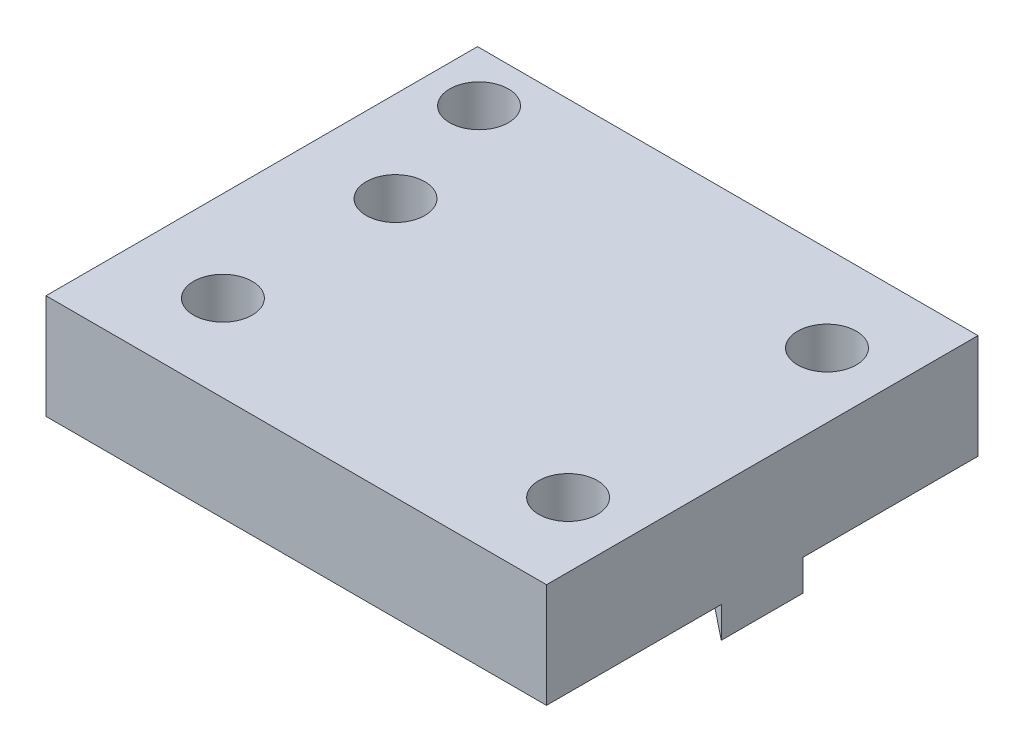
ISO-10303-21;
HEADER;
FILE_DESCRIPTION(('STEP AP214'),'2;1');
FILE_NAME('part.step','',(''),(''),'','','');
FILE_SCHEMA(('AUTOMOTIVE_DESIGN { 1 0 10303 214 1 1 1 1 }'));
ENDSEC;
DATA;
#1=APPLICATION_CONTEXT('core data for automotive mechanical design processes');
#2=APPLICATION_PROTOCOL_DEFINITION('international standard','automotive_design',2000,#1);
#3=PRODUCT_CONTEXT('',#1,'mechanical');
#4=PRODUCT('Part','Part','',(#3));
#5=PRODUCT_RELATED_PRODUCT_CATEGORY('part','',(#4));
#6=PRODUCT_DEFINITION_FORMATION('','',#4);
#7=PRODUCT_DEFINITION_CONTEXT('part definition',#1,'design');
#8=PRODUCT_DEFINITION('design','',#6,#7);
#9=PRODUCT_DEFINITION_SHAPE('','',#8);
#10=(LENGTH_UNIT() NAMED_UNIT(*) SI_UNIT(.MILLI.,.METRE.));
#11=(NAMED_UNIT(*) PLANE_ANGLE_UNIT() SI_UNIT($,.RADIAN.));
#12=(NAMED_UNIT(*) SI_UNIT($,.STERADIAN.) SOLID_ANGLE_UNIT());
#13=UNCERTAINTY_MEASURE_WITH_UNIT(LENGTH_MEASURE(1.E-05),#10,'distance_accuracy_value','');
#14=(GEOMETRIC_REPRESENTATION_CONTEXT(3) GLOBAL_UNCERTAINTY_ASSIGNED_CONTEXT((#13)) GLOBAL_UNIT_ASSIGNED_CONTEXT((#10,
#11,#12)) REPRESENTATION_CONTEXT('',''));
#15=CARTESIAN_POINT('',(0.,0.,0.));
#16=DIRECTION('',(0.,0.,1.));
#17=DIRECTION('',(1.,0.,0.));
#18=AXIS2_PLACEMENT_3D('',#15,#16,#17);
#19=CARTESIAN_POINT('',(0.,15.4164043197796,57.0004422851704));
#20=DIRECTION('',(0.,0.,-1.));
#21=DIRECTION('',(-1.,0.,0.));
#22=AXIS2_PLACEMENT_3D('',#19,#20,#21);
#23=CYLINDRICAL_SURFACE('',#22,12.);
#24=DIRECTION('',(0.,0.,-1.));
#25=VECTOR('',#24,1.);
#26=CARTESIAN_POINT('',(8.83271594697806,23.5394043197795,57.0004422851701));
#27=LINE('',#26,#25);
#28=CARTESIAN_POINT('',(8.83271594697806,23.5394043197795,57.5004422851702));
#29=VERTEX_POINT('',#28);
#30=CARTESIAN_POINT('',(8.83271594697801,23.5394043197795,53.5004422851702));
#31=VERTEX_POINT('',#30);
#32=EDGE_CURVE('E265',#29,#31,#27,.T.);
#33=ORIENTED_EDGE('',*,*,#32,.F.);
#34=CARTESIAN_POINT('',(0.,15.4164043197796,57.5004422851702));
#35=DIRECTION('',(0.,0.,1.));
#36=DIRECTION('',(-1.,0.,0.));
#37=AXIS2_PLACEMENT_3D('',#34,#35,#36);
#38=CIRCLE('',#37,12.);
#39=CARTESIAN_POINT('',(-8.83271594697804,23.5394043197795,57.5004422851704));
#40=VERTEX_POINT('',#39);
#41=EDGE_CURVE('E9',#29,#40,#38,.T.);
#42=ORIENTED_EDGE('',*,*,#41,.T.);
#43=DIRECTION('',(0.,0.,1.));
#44=VECTOR('',#43,1.);
#45=CARTESIAN_POINT('',(-8.83271594697804,23.5394043197795,57.0004422851704));
#46=LINE('',#45,#44);
#47=CARTESIAN_POINT('',(-8.83271594697809,23.5394043197795,53.5004422851704));
#48=VERTEX_POINT('',#47);
#49=EDGE_CURVE('E333',#48,#40,#46,.T.);
#50=ORIENTED_EDGE('',*,*,#49,.F.);
#51=CARTESIAN_POINT('',(0.,15.4164043197796,53.5004422851702));
#52=DIRECTION('',(0.,0.,-1.));
#53=DIRECTION('',(-1.,0.,0.));
#54=AXIS2_PLACEMENT_3D('',#51,#52,#53);
#55=CIRCLE('',#54,12.);
#56=EDGE_CURVE('E24',#48,#31,#55,.T.);
#57=ORIENTED_EDGE('',*,*,#56,.T.);
#58=EDGE_LOOP('',(#33,#42,#50,#57));
#59=FACE_BOUND('',#58,.T.);
#60=ADVANCED_FACE('F14',(#59),#23,.F.);
#61=CARTESIAN_POINT('',(0.499999999999862,15.4164043197796,57.5004422851702));
#62=DIRECTION('',(0.,0.,-1.));
#63=DIRECTION('',(-1.,0.,0.));
#64=AXIS2_PLACEMENT_3D('',#61,#62,#63);
#65=PLANE('',#64);
#66=DIRECTION('',(1.,0.,0.));
#67=VECTOR('',#66,1.);
#68=CARTESIAN_POINT('',(-0.067499858140971,23.5394043197795,57.5004422851702));
#69=LINE('',#68,#67);
#70=EDGE_CURVE('E311',#40,#29,#69,.T.);
#71=ORIENTED_EDGE('',*,*,#70,.F.);
#72=ORIENTED_EDGE('',*,*,#41,.F.);
#73=EDGE_LOOP('',(#71,#72));
#74=FACE_BOUND('',#73,.T.);
#75=ADVANCED_FACE('F591',(#74),#65,.T.);
#76=CARTESIAN_POINT('',(0.499999999999811,15.4164043197796,53.5004422851702));
#77=DIRECTION('',(0.,0.,-1.));
#78=DIRECTION('',(-1.,0.,0.));
#79=AXIS2_PLACEMENT_3D('',#76,#77,#78);
#80=PLANE('',#79);
#81=CARTESIAN_POINT('',(0.,15.4164043197796,53.5004422851702));
#82=DIRECTION('',(0.,0.,-1.));
#83=DIRECTION('',(-1.,0.,0.));
#84=AXIS2_PLACEMENT_3D('',#81,#82,#83);
#85=CIRCLE('',#84,10.668);
#86=CARTESIAN_POINT('',(-6.91542442659887,23.5394043197795,53.5004422851704));
#87=VERTEX_POINT('',#86);
#88=CARTESIAN_POINT('',(6.9154244265989,23.5394043197795,53.5004422851702));
#89=VERTEX_POINT('',#88);
#90=EDGE_CURVE('E350',#87,#89,#85,.T.);
#91=ORIENTED_EDGE('',*,*,#90,.T.);
#92=DIRECTION('',(-1.,0.,0.));
#93=VECTOR('',#92,1.);
#94=CARTESIAN_POINT('',(-0.0674998581410224,23.5394043197795,53.5004422851702));
#95=LINE('',#94,#93);
#96=EDGE_CURVE('E260',#31,#89,#95,.T.);
#97=ORIENTED_EDGE('',*,*,#96,.F.);
#98=ORIENTED_EDGE('',*,*,#56,.F.);
#99=DIRECTION('',(-1.,0.,0.));
#100=VECTOR('',#99,1.);
#101=CARTESIAN_POINT('',(-0.0674998581410224,23.5394043197795,53.5004422851702));
#102=LINE('',#101,#100);
#103=EDGE_CURVE('E332',#87,#48,#102,.T.);
#104=ORIENTED_EDGE('',*,*,#103,.F.);
#105=EDGE_LOOP('',(#91,#97,#98,#104));
#106=FACE_BOUND('',#105,.T.);
#107=ADVANCED_FACE('F679',(#106),#80,.F.);
#108=CARTESIAN_POINT('',(0.,15.4164043197796,35.5120422851699));
#109=DIRECTION('',(0.,0.,1.));
#110=DIRECTION('',(-1.,0.,0.));
#111=AXIS2_PLACEMENT_3D('',#108,#109,#110);
#112=CYLINDRICAL_SURFACE('',#111,10.668);
#113=ORIENTED_EDGE('',*,*,#90,.F.);
#114=DIRECTION('',(0.,0.,1.));
#115=VECTOR('',#114,1.);
#116=CARTESIAN_POINT('',(-6.91542442659887,23.5394043197795,35.5120422851699));
#117=LINE('',#116,#115);
#118=CARTESIAN_POINT('',(-6.91542442659887,23.5394043197795,35.5120422851699));
#119=VERTEX_POINT('',#118);
#120=EDGE_CURVE('E328',#119,#87,#117,.T.);
#121=ORIENTED_EDGE('',*,*,#120,.F.);
#122=CARTESIAN_POINT('',(0.,15.4164043197796,35.5120422851699));
#123=DIRECTION('',(0.,0.,1.));
#124=DIRECTION('',(-1.,0.,0.));
#125=AXIS2_PLACEMENT_3D('',#122,#123,#124);
#126=CIRCLE('',#125,10.668);
#127=CARTESIAN_POINT('',(6.9154244265989,23.5394043197795,35.5120422851699));
#128=VERTEX_POINT('',#127);
#129=EDGE_CURVE('E341',#128,#119,#126,.T.);
#130=ORIENTED_EDGE('',*,*,#129,.F.);
#131=DIRECTION('',(0.,0.,-1.));
#132=VECTOR('',#131,1.);
#133=CARTESIAN_POINT('',(6.9154244265989,23.5394043197795,35.5120422851699));
#134=LINE('',#133,#132);
#135=EDGE_CURVE('E264',#89,#128,#134,.T.);
#136=ORIENTED_EDGE('',*,*,#135,.F.);
#137=EDGE_LOOP('',(#113,#121,#130,#136));
#138=FACE_BOUND('',#137,.T.);
#139=ADVANCED_FACE('F683',(#138),#112,.F.);
#140=CARTESIAN_POINT('',(13.0175,28.3654043197795,60.9120422851699));
#141=DIRECTION('',(0.,-1.,0.));
#142=DIRECTION('',(0.,0.,1.));
#143=AXIS2_PLACEMENT_3D('',#140,#141,#142);
#144=CYLINDRICAL_SURFACE('',#143,2.159);
#145=CARTESIAN_POINT('',(13.0175,31.2307783197794,60.9120422851699));
#146=DIRECTION('',(0.,1.,0.));
#147=DIRECTION('',(0.,0.,1.));
#148=AXIS2_PLACEMENT_3D('',#145,#146,#147);
#149=CIRCLE('',#148,2.159);
#150=CARTESIAN_POINT('',(13.0175,31.2307783197794,58.7530422851699));
#151=VERTEX_POINT('',#150);
#152=EDGE_CURVE('E289',#151,#151,#149,.T.);
#153=ORIENTED_EDGE('',*,*,#152,.T.);
#154=DIRECTION('',(0.,-1.,0.));
#155=VECTOR('',#154,1.);
#156=CARTESIAN_POINT('',(13.0175,28.3654043197795,58.7530422851699));
#157=LINE('',#156,#155);
#158=CARTESIAN_POINT('',(13.0175,23.5394043197795,58.7530422851699));
#159=VERTEX_POINT('',#158);
#160=EDGE_CURVE('E351',#151,#159,#157,.T.);
#161=ORIENTED_EDGE('',*,*,#160,.T.);
#162=CARTESIAN_POINT('',(13.0175,23.5394043197795,60.9120422851699));
#163=DIRECTION('',(0.,1.,0.));
#164=DIRECTION('',(0.,0.,1.));
#165=AXIS2_PLACEMENT_3D('',#162,#163,#164);
#166=CIRCLE('',#165,2.159);
#167=EDGE_CURVE('E301',#159,#159,#166,.T.);
#168=ORIENTED_EDGE('',*,*,#167,.F.);
#169=ORIENTED_EDGE('',*,*,#160,.F.);
#170=EDGE_LOOP('',(#153,#161,#168,#169));
#171=FACE_BOUND('',#170,.T.);
#172=ADVANCED_FACE('F697',(#171),#144,.F.);
#173=CARTESIAN_POINT('',(-15.2199031805057,28.3654043197795,39.22604228517));
#174=DIRECTION('',(0.,-1.,0.));
#175=DIRECTION('',(0.,0.,1.));
#176=AXIS2_PLACEMENT_3D('',#173,#174,#175);
#177=CYLINDRICAL_SURFACE('',#176,2.159);
#178=CARTESIAN_POINT('',(-15.2199031805057,31.2307783197794,39.22604228517));
#179=DIRECTION('',(0.,1.,0.));
#180=DIRECTION('',(0.,0.,1.));
#181=AXIS2_PLACEMENT_3D('',#178,#179,#180);
#182=CIRCLE('',#181,2.159);
#183=CARTESIAN_POINT('',(-15.2199031805057,31.2307783197794,37.06704228517));
#184=VERTEX_POINT('',#183);
#185=EDGE_CURVE('E285',#184,#184,#182,.T.);
#186=ORIENTED_EDGE('',*,*,#185,.T.);
#187=DIRECTION('',(0.,-1.,0.));
#188=VECTOR('',#187,1.);
#189=CARTESIAN_POINT('',(-15.2199031805057,28.3654043197795,37.06704228517));
#190=LINE('',#189,#188);
#191=CARTESIAN_POINT('',(-15.2199031805057,23.5394043197795,37.06704228517));
#192=VERTEX_POINT('',#191);
#193=EDGE_CURVE('E269',#184,#192,#190,.T.);
#194=ORIENTED_EDGE('',*,*,#193,.T.);
#195=CARTESIAN_POINT('',(-15.2199031805057,23.5394043197795,39.22604228517));
#196=DIRECTION('',(0.,1.,0.));
#197=DIRECTION('',(0.,0.,1.));
#198=AXIS2_PLACEMENT_3D('',#195,#196,#197);
#199=CIRCLE('',#198,2.159);
#200=EDGE_CURVE('E284',#192,#192,#199,.T.);
#201=ORIENTED_EDGE('',*,*,#200,.F.);
#202=ORIENTED_EDGE('',*,*,#193,.F.);
#203=EDGE_LOOP('',(#186,#194,#201,#202));
#204=FACE_BOUND('',#203,.T.);
#205=ADVANCED_FACE('F619',(#204),#177,.F.);
#206=CARTESIAN_POINT('',(-12.3825,28.3654043197795,60.9120422851699));
#207=DIRECTION('',(0.,-1.,0.));
#208=DIRECTION('',(0.,0.,1.));
#209=AXIS2_PLACEMENT_3D('',#206,#207,#208);
#210=CYLINDRICAL_SURFACE('',#209,2.159);
#211=CARTESIAN_POINT('',(-12.3825,31.2307783197794,60.9120422851699));
#212=DIRECTION('',(0.,1.,0.));
#213=DIRECTION('',(0.,0.,1.));
#214=AXIS2_PLACEMENT_3D('',#211,#212,#213);
#215=CIRCLE('',#214,2.159);
#216=CARTESIAN_POINT('',(-12.3825,31.2307783197794,58.7530422851699));
#217=VERTEX_POINT('',#216);
#218=EDGE_CURVE('E290',#217,#217,#215,.T.);
#219=ORIENTED_EDGE('',*,*,#218,.T.);
#220=DIRECTION('',(0.,-1.,0.));
#221=VECTOR('',#220,1.);
#222=CARTESIAN_POINT('',(-12.3825,28.3654043197795,58.7530422851699));
#223=LINE('',#222,#221);
#224=CARTESIAN_POINT('',(-12.3825,23.5394043197795,58.7530422851699));
#225=VERTEX_POINT('',#224);
#226=EDGE_CURVE('E266',#217,#225,#223,.T.);
#227=ORIENTED_EDGE('',*,*,#226,.T.);
#228=CARTESIAN_POINT('',(-12.3825,23.5394043197795,60.9120422851699));
#229=DIRECTION('',(0.,1.,0.));
#230=DIRECTION('',(0.,0.,1.));
#231=AXIS2_PLACEMENT_3D('',#228,#229,#230);
#232=CIRCLE('',#231,2.159);
#233=EDGE_CURVE('E279',#225,#225,#232,.T.);
#234=ORIENTED_EDGE('',*,*,#233,.F.);
#235=ORIENTED_EDGE('',*,*,#226,.F.);
#236=EDGE_LOOP('',(#219,#227,#234,#235));
#237=FACE_BOUND('',#236,.T.);
#238=ADVANCED_FACE('F615',(#237),#210,.F.);
#239=CARTESIAN_POINT('',(-12.3825,28.3654043197795,48.2120422851699));
#240=DIRECTION('',(0.,-1.,0.));
#241=DIRECTION('',(0.,0.,1.));
#242=AXIS2_PLACEMENT_3D('',#239,#240,#241);
#243=CYLINDRICAL_SURFACE('',#242,2.159);
#244=CARTESIAN_POINT('',(-12.3825,31.2307783197794,48.2120422851699));
#245=DIRECTION('',(0.,1.,0.));
#246=DIRECTION('',(0.,0.,1.));
#247=AXIS2_PLACEMENT_3D('',#244,#245,#246);
#248=CIRCLE('',#247,2.159);
#249=CARTESIAN_POINT('',(-12.3825,31.2307783197794,46.0530422851699));
#250=VERTEX_POINT('',#249);
#251=EDGE_CURVE('E241',#250,#250,#248,.T.);
#252=ORIENTED_EDGE('',*,*,#251,.T.);
#253=DIRECTION('',(0.,-1.,0.));
#254=VECTOR('',#253,1.);
#255=CARTESIAN_POINT('',(-12.3825,28.3654043197795,46.0530422851699));
#256=LINE('',#255,#254);
#257=CARTESIAN_POINT('',(-12.3825,23.5394043197795,46.0530422851699));
#258=VERTEX_POINT('',#257);
#259=EDGE_CURVE('E270',#250,#258,#256,.T.);
#260=ORIENTED_EDGE('',*,*,#259,.T.);
#261=CARTESIAN_POINT('',(-12.3825,23.5394043197795,48.2120422851699));
#262=DIRECTION('',(0.,1.,0.));
#263=DIRECTION('',(0.,0.,1.));
#264=AXIS2_PLACEMENT_3D('',#261,#262,#263);
#265=CIRCLE('',#264,2.159);
#266=EDGE_CURVE('E283',#258,#258,#265,.T.);
#267=ORIENTED_EDGE('',*,*,#266,.F.);
#268=ORIENTED_EDGE('',*,*,#259,.F.);
#269=EDGE_LOOP('',(#252,#260,#267,#268));
#270=FACE_BOUND('',#269,.T.);
#271=ADVANCED_FACE('F429',(#270),#243,.F.);
#272=CARTESIAN_POINT('',(13.0175,28.3654043197795,41.8620422851699));
#273=DIRECTION('',(0.,-1.,0.));
#274=DIRECTION('',(0.,0.,1.));
#275=AXIS2_PLACEMENT_3D('',#272,#273,#274);
#276=CYLINDRICAL_SURFACE('',#275,2.159);
#277=CARTESIAN_POINT('',(13.0175,31.2307783197794,41.8620422851699));
#278=DIRECTION('',(0.,1.,0.));
#279=DIRECTION('',(0.,0.,1.));
#280=AXIS2_PLACEMENT_3D('',#277,#278,#279);
#281=CIRCLE('',#280,2.159);
#282=CARTESIAN_POINT('',(13.0175,31.2307783197794,39.7030422851699));
#283=VERTEX_POINT('',#282);
#284=EDGE_CURVE('E403',#283,#283,#281,.T.);
#285=ORIENTED_EDGE('',*,*,#284,.T.);
#286=DIRECTION('',(0.,-1.,0.));
#287=VECTOR('',#286,1.);
#288=CARTESIAN_POINT('',(13.0175,28.3654043197795,39.7030422851699));
#289=LINE('',#288,#287);
#290=CARTESIAN_POINT('',(13.0175,23.5394043197795,39.7030422851699));
#291=VERTEX_POINT('',#290);
#292=EDGE_CURVE('E361',#283,#291,#289,.T.);
#293=ORIENTED_EDGE('',*,*,#292,.T.);
#294=CARTESIAN_POINT('',(13.0175,23.5394043197795,41.8620422851699));
#295=DIRECTION('',(0.,1.,0.));
#296=DIRECTION('',(0.,0.,1.));
#297=AXIS2_PLACEMENT_3D('',#294,#295,#296);
#298=CIRCLE('',#297,2.159);
#299=EDGE_CURVE('E387',#291,#291,#298,.T.);
#300=ORIENTED_EDGE('',*,*,#299,.F.);
#301=ORIENTED_EDGE('',*,*,#292,.F.);
#302=EDGE_LOOP('',(#285,#293,#300,#301));
#303=FACE_BOUND('',#302,.T.);
#304=ADVANCED_FACE('F692',(#303),#276,.F.);
#305=CARTESIAN_POINT('',(-0.63500000000001,21.2534043197795,52.6522563891725));
#306=DIRECTION('',(0.,-1.,0.));
#307=DIRECTION('',(0.,0.,-1.));
#308=AXIS2_PLACEMENT_3D('',#305,#306,#307);
#309=PLANE('',#308);
#310=DIRECTION('',(0.782566722810013,0.,-0.62256672281001));
#311=VECTOR('',#310,1.);
#312=CARTESIAN_POINT('',(9.39302657442434,21.2534043197795,55.0465401036437));
#313=LINE('',#312,#311);
#314=CARTESIAN_POINT('',(14.3678020786094,21.2534043197795,51.0888843637793));
#315=VERTEX_POINT('',#314);
#316=CARTESIAN_POINT('',(17.78,21.2534043197795,48.3743287666905));
#317=VERTEX_POINT('',#316);
#318=EDGE_CURVE('E364',#315,#317,#313,.T.);
#319=ORIENTED_EDGE('',*,*,#318,.T.);
#320=DIRECTION('',(0.,0.,1.));
#321=VECTOR('',#320,1.);
#322=CARTESIAN_POINT('',(17.78,21.2534043197795,50.5132925779316));
#323=LINE('',#322,#321);
#324=CARTESIAN_POINT('',(17.78,21.2534043197795,54.3997558036493));
#325=VERTEX_POINT('',#324);
#326=EDGE_CURVE('E17',#317,#325,#323,.T.);
#327=ORIENTED_EDGE('',*,*,#326,.T.);
#328=DIRECTION('',(-0.782566722810013,0.,-0.62256672281001));
#329=VECTOR('',#328,1.);
#330=CARTESIAN_POINT('',(11.7155378465897,21.2534043197795,49.5752057449693));
#331=LINE('',#330,#329);
#332=CARTESIAN_POINT('',(14.3678020786094,21.2534043197795,51.6852002065605));
#333=VERTEX_POINT('',#332);
#334=EDGE_CURVE('E36',#325,#333,#331,.T.);
#335=ORIENTED_EDGE('',*,*,#334,.T.);
#336=CARTESIAN_POINT('',(14.605,21.2534043197795,51.3870422851699));
#337=DIRECTION('',(0.,-1.,0.));
#338=DIRECTION('',(-0.622566722810002,0.,-0.78256672281002));
#339=AXIS2_PLACEMENT_3D('',#336,#337,#338);
#340=CIRCLE('',#339,0.381);
#341=EDGE_CURVE('E277',#333,#315,#340,.T.);
#342=ORIENTED_EDGE('',*,*,#341,.T.);
#343=EDGE_LOOP('',(#319,#327,#335,#342));
#344=FACE_BOUND('',#343,.T.);
#345=ADVANCED_FACE('F673',(#344),#309,.T.);
#346=CARTESIAN_POINT('',(14.3678020786094,23.5394043197795,51.0888843637793));
#347=DIRECTION('',(-0.62256672281001,0.,-0.782566722810013));
#348=DIRECTION('',(-0.782566722810013,0.,0.62256672281001));
#349=AXIS2_PLACEMENT_3D('',#346,#347,#348);
#350=PLANE('',#349);
#351=DIRECTION('',(-0.782566722810013,0.,0.62256672281001));
#352=VECTOR('',#351,1.);
#353=CARTESIAN_POINT('',(9.70123281703539,23.5394043197795,54.8013482946656));
#354=LINE('',#353,#352);
#355=CARTESIAN_POINT('',(17.78,23.5394043197795,48.3743287666905));
#356=VERTEX_POINT('',#355);
#357=CARTESIAN_POINT('',(14.3678020786094,23.5394043197795,51.0888843637793));
#358=VERTEX_POINT('',#357);
#359=EDGE_CURVE('E327',#356,#358,#354,.T.);
#360=ORIENTED_EDGE('',*,*,#359,.F.);
#361=DIRECTION('',(0.,-1.,0.));
#362=VECTOR('',#361,1.);
#363=CARTESIAN_POINT('',(17.78,23.5394043197795,48.3743287666905));
#364=LINE('',#363,#362);
#365=EDGE_CURVE('E248',#356,#317,#364,.T.);
#366=ORIENTED_EDGE('',*,*,#365,.T.);
#367=ORIENTED_EDGE('',*,*,#318,.F.);
#368=DIRECTION('',(0.,-1.,0.));
#369=VECTOR('',#368,1.);
#370=CARTESIAN_POINT('',(14.3678020786094,23.5394043197795,51.0888843637793));
#371=LINE('',#370,#369);
#372=EDGE_CURVE('E273',#358,#315,#371,.T.);
#373=ORIENTED_EDGE('',*,*,#372,.F.);
#374=EDGE_LOOP('',(#360,#366,#367,#373));
#375=FACE_BOUND('',#374,.T.);
#376=ADVANCED_FACE('F668',(#375),#350,.T.);
#377=CARTESIAN_POINT('',(17.78,23.5394043197795,54.3997558036493));
#378=DIRECTION('',(-0.62256672281001,0.,0.782566722810013));
#379=DIRECTION('',(0.,1.,0.));
#380=AXIS2_PLACEMENT_3D('',#377,#378,#379);
#381=PLANE('',#380);
#382=DIRECTION('',(0.782566722810013,0.,0.62256672281001));
#383=VECTOR('',#382,1.);
#384=CARTESIAN_POINT('',(11.4073317777307,23.5394043197795,49.3300140742185));
#385=LINE('',#384,#383);
#386=CARTESIAN_POINT('',(14.3678020786094,23.5394043197795,51.6852002065605));
#387=VERTEX_POINT('',#386);
#388=CARTESIAN_POINT('',(17.78,23.5394043197795,54.3997558036493));
#389=VERTEX_POINT('',#388);
#390=EDGE_CURVE('E213',#387,#389,#385,.T.);
#391=ORIENTED_EDGE('',*,*,#390,.F.);
#392=DIRECTION('',(0.,-1.,0.));
#393=VECTOR('',#392,1.);
#394=CARTESIAN_POINT('',(14.3678020786094,23.5394043197795,51.6852002065605));
#395=LINE('',#394,#393);
#396=EDGE_CURVE('E345',#387,#333,#395,.T.);
#397=ORIENTED_EDGE('',*,*,#396,.T.);
#398=ORIENTED_EDGE('',*,*,#334,.F.);
#399=DIRECTION('',(0.,-1.,0.));
#400=VECTOR('',#399,1.);
#401=CARTESIAN_POINT('',(17.78,23.5394043197795,54.3997558036493));
#402=LINE('',#401,#400);
#403=EDGE_CURVE('E294',#389,#325,#402,.T.);
#404=ORIENTED_EDGE('',*,*,#403,.F.);
#405=EDGE_LOOP('',(#391,#397,#398,#404));
#406=FACE_BOUND('',#405,.T.);
#407=ADVANCED_FACE('F672',(#406),#381,.T.);
#408=CARTESIAN_POINT('',(14.605,23.5394043197795,51.3870422851699));
#409=DIRECTION('',(0.,-1.,0.));
#410=DIRECTION('',(-0.622566722810002,0.,-0.78256672281002));
#411=AXIS2_PLACEMENT_3D('',#408,#409,#410);
#412=CYLINDRICAL_SURFACE('',#411,0.381);
#413=CARTESIAN_POINT('',(14.605,23.5394043197795,51.3870422851699));
#414=DIRECTION('',(0.,1.,0.));
#415=DIRECTION('',(-0.622566722810002,0.,-0.78256672281002));
#416=AXIS2_PLACEMENT_3D('',#413,#414,#415);
#417=CIRCLE('',#416,0.381);
#418=EDGE_CURVE('E323',#358,#387,#417,.T.);
#419=ORIENTED_EDGE('',*,*,#418,.F.);
#420=ORIENTED_EDGE('',*,*,#372,.T.);
#421=ORIENTED_EDGE('',*,*,#341,.F.);
#422=ORIENTED_EDGE('',*,*,#396,.F.);
#423=EDGE_LOOP('',(#419,#420,#421,#422));
#424=FACE_BOUND('',#423,.T.);
#425=ADVANCED_FACE('F628',(#424),#412,.T.);
#426=CARTESIAN_POINT('',(-0.63500000000001,21.2534043197795,52.6522563891725));
#427=DIRECTION('',(0.,-1.,0.));
#428=DIRECTION('',(0.,0.,-1.));
#429=AXIS2_PLACEMENT_3D('',#426,#427,#428);
#430=PLANE('',#429);
#431=DIRECTION('',(0.,0.,-1.));
#432=VECTOR('',#431,1.);
#433=CARTESIAN_POINT('',(-19.05,21.2534043197795,54.7912202004136));
#434=LINE('',#433,#432);
#435=CARTESIAN_POINT('',(-19.05,21.2534043197795,56.9301840116544));
#436=VERTEX_POINT('',#435);
#437=CARTESIAN_POINT('',(-19.05,21.2534043197795,52.1939005586853));
#438=VERTEX_POINT('',#437);
#439=EDGE_CURVE('E230',#436,#438,#434,.T.);
#440=ORIENTED_EDGE('',*,*,#439,.T.);
#441=DIRECTION('',(0.738981006862124,0.,0.673726258577652));
#442=VECTOR('',#441,1.);
#443=CARTESIAN_POINT('',(-13.9077483438438,21.2534043197795,56.8820724288633));
#444=LINE('',#443,#442);
#445=CARTESIAN_POINT('',(-16.7613102954819,21.2534043197795,54.2804905215555));
#446=VERTEX_POINT('',#445);
#447=EDGE_CURVE('E278',#438,#446,#444,.T.);
#448=ORIENTED_EDGE('',*,*,#447,.T.);
#449=CARTESIAN_POINT('',(-17.018,21.2534043197795,54.5620422851699));
#450=DIRECTION('',(0.,-1.,0.));
#451=DIRECTION('',(0.673726258577663,0.,0.738981006862114));
#452=AXIS2_PLACEMENT_3D('',#449,#450,#451);
#453=CIRCLE('',#452,0.381);
#454=CARTESIAN_POINT('',(-16.7613102954819,21.2534043197795,54.8435940487843));
#455=VERTEX_POINT('',#454);
#456=EDGE_CURVE('E255',#446,#455,#453,.T.);
#457=ORIENTED_EDGE('',*,*,#456,.T.);
#458=DIRECTION('',(-0.738981006862122,0.,0.673726258577654));
#459=VECTOR('',#458,1.);
#460=CARTESIAN_POINT('',(-11.8125766517151,21.2534043197795,50.3318518368029));
#461=LINE('',#460,#459);
#462=EDGE_CURVE('E256',#455,#436,#461,.T.);
#463=ORIENTED_EDGE('',*,*,#462,.T.);
#464=EDGE_LOOP('',(#440,#448,#457,#463));
#465=FACE_BOUND('',#464,.T.);
#466=ADVANCED_FACE('F609',(#465),#430,.T.);
#467=CARTESIAN_POINT('',(-19.05,23.5394043197795,52.1939005586853));
#468=DIRECTION('',(0.673726258577652,0.,-0.738981006862124));
#469=DIRECTION('',(0.,-1.,0.));
#470=AXIS2_PLACEMENT_3D('',#467,#468,#469);
#471=PLANE('',#470);
#472=DIRECTION('',(-0.738981006862124,0.,-0.673726258577652));
#473=VECTOR('',#472,1.);
#474=CARTESIAN_POINT('',(-14.2227049143404,23.5394043197795,56.5949276851085));
#475=LINE('',#474,#473);
#476=CARTESIAN_POINT('',(-16.7613102954819,23.5394043197795,54.2804905215555));
#477=VERTEX_POINT('',#476);
#478=CARTESIAN_POINT('',(-19.05,23.5394043197795,52.1939005586853));
#479=VERTEX_POINT('',#478);
#480=EDGE_CURVE('E259',#477,#479,#475,.T.);
#481=ORIENTED_EDGE('',*,*,#480,.F.);
#482=DIRECTION('',(0.,-1.,0.));
#483=VECTOR('',#482,1.);
#484=CARTESIAN_POINT('',(-16.7613102954819,23.5394043197795,54.2804905215555));
#485=LINE('',#484,#483);
#486=EDGE_CURVE('E293',#477,#446,#485,.T.);
#487=ORIENTED_EDGE('',*,*,#486,.T.);
#488=ORIENTED_EDGE('',*,*,#447,.F.);
#489=DIRECTION('',(0.,-1.,0.));
#490=VECTOR('',#489,1.);
#491=CARTESIAN_POINT('',(-19.05,23.5394043197795,52.1939005586853));
#492=LINE('',#491,#490);
#493=EDGE_CURVE('E237',#479,#438,#492,.T.);
#494=ORIENTED_EDGE('',*,*,#493,.F.);
#495=EDGE_LOOP('',(#481,#487,#488,#494));
#496=FACE_BOUND('',#495,.T.);
#497=ADVANCED_FACE('F604',(#496),#471,.T.);
#498=CARTESIAN_POINT('',(-17.018,23.5394043197795,54.5620422851699));
#499=DIRECTION('',(0.,-1.,0.));
#500=DIRECTION('',(0.673726258577663,0.,0.738981006862114));
#501=AXIS2_PLACEMENT_3D('',#498,#499,#500);
#502=CYLINDRICAL_SURFACE('',#501,0.381);
#503=CARTESIAN_POINT('',(-17.018,23.5394043197795,54.5620422851699));
#504=DIRECTION('',(0.,1.,0.));
#505=DIRECTION('',(0.673726258577663,0.,0.738981006862114));
#506=AXIS2_PLACEMENT_3D('',#503,#504,#505);
#507=CIRCLE('',#506,0.381);
#508=CARTESIAN_POINT('',(-16.7613102954819,23.5394043197795,54.8435940487843));
#509=VERTEX_POINT('',#508);
#510=EDGE_CURVE('E212',#509,#477,#507,.T.);
#511=ORIENTED_EDGE('',*,*,#510,.F.);
#512=DIRECTION('',(0.,-1.,0.));
#513=VECTOR('',#512,1.);
#514=CARTESIAN_POINT('',(-16.7613102954819,23.5394043197795,54.8435940487843));
#515=LINE('',#514,#513);
#516=EDGE_CURVE('E207',#509,#455,#515,.T.);
#517=ORIENTED_EDGE('',*,*,#516,.T.);
#518=ORIENTED_EDGE('',*,*,#456,.F.);
#519=ORIENTED_EDGE('',*,*,#486,.F.);
#520=EDGE_LOOP('',(#511,#517,#518,#519));
#521=FACE_BOUND('',#520,.T.);
#522=ADVANCED_FACE('F608',(#521),#502,.T.);
#523=CARTESIAN_POINT('',(-16.7613102954819,23.5394043197795,54.8435940487843));
#524=DIRECTION('',(0.673726258577654,0.,0.738981006862122));
#525=DIRECTION('',(0.,-1.,0.));
#526=AXIS2_PLACEMENT_3D('',#523,#524,#525);
#527=PLANE('',#526);
#528=DIRECTION('',(0.738981006862122,0.,-0.673726258577654));
#529=VECTOR('',#528,1.);
#530=CARTESIAN_POINT('',(-11.4976199262821,23.5394043197795,50.0447069517931));
#531=LINE('',#530,#529);
#532=CARTESIAN_POINT('',(-19.05,23.5394043197795,56.9301840116544));
#533=VERTEX_POINT('',#532);
#534=EDGE_CURVE('E199',#533,#509,#531,.T.);
#535=ORIENTED_EDGE('',*,*,#534,.F.);
#536=DIRECTION('',(0.,-1.,0.));
#537=VECTOR('',#536,1.);
#538=CARTESIAN_POINT('',(-19.05,23.5394043197795,56.9301840116544));
#539=LINE('',#538,#537);
#540=EDGE_CURVE('E204',#533,#436,#539,.T.);
#541=ORIENTED_EDGE('',*,*,#540,.T.);
#542=ORIENTED_EDGE('',*,*,#462,.F.);
#543=ORIENTED_EDGE('',*,*,#516,.F.);
#544=EDGE_LOOP('',(#535,#541,#542,#543));
#545=FACE_BOUND('',#544,.T.);
#546=ADVANCED_FACE('F201',(#545),#527,.T.);
#547=CARTESIAN_POINT('',(-0.634999716281886,23.5394043197795,51.3870422851699));
#548=DIRECTION('',(0.,1.,0.));
#549=DIRECTION('',(0.,0.,-1.));
#550=AXIS2_PLACEMENT_3D('',#547,#548,#549);
#551=PLANE('',#550);
#552=ORIENTED_EDGE('',*,*,#299,.T.);
#553=EDGE_LOOP('',(#552));
#554=FACE_BOUND('',#553,.T.);
#555=ORIENTED_EDGE('',*,*,#266,.T.);
#556=EDGE_LOOP('',(#555));
#557=FACE_BOUND('',#556,.T.);
#558=ORIENTED_EDGE('',*,*,#233,.T.);
#559=EDGE_LOOP('',(#558));
#560=FACE_BOUND('',#559,.T.);
#561=ORIENTED_EDGE('',*,*,#200,.T.);
#562=EDGE_LOOP('',(#561));
#563=FACE_BOUND('',#562,.T.);
#564=ORIENTED_EDGE('',*,*,#167,.T.);
#565=EDGE_LOOP('',(#564));
#566=FACE_BOUND('',#565,.T.);
#567=DIRECTION('',(1.,0.,0.));
#568=VECTOR('',#567,1.);
#569=CARTESIAN_POINT('',(-19.05,23.5394043197795,35.5120422851699));
#570=LINE('',#569,#568);
#571=CARTESIAN_POINT('',(17.78,23.5394043197795,35.5120422851699));
#572=VERTEX_POINT('',#571);
#573=EDGE_CURVE('E318',#128,#572,#570,.T.);
#574=ORIENTED_EDGE('',*,*,#573,.T.);
#575=DIRECTION('',(0.,0.,-1.));
#576=VECTOR('',#575,1.);
#577=CARTESIAN_POINT('',(17.78,23.5394043197795,67.2620422851699));
#578=LINE('',#577,#576);
#579=EDGE_CURVE('E252',#356,#572,#578,.T.);
#580=ORIENTED_EDGE('',*,*,#579,.F.);
#581=ORIENTED_EDGE('',*,*,#359,.T.);
#582=ORIENTED_EDGE('',*,*,#418,.T.);
#583=ORIENTED_EDGE('',*,*,#390,.T.);
#584=DIRECTION('',(0.,0.,-1.));
#585=VECTOR('',#584,1.);
#586=CARTESIAN_POINT('',(17.78,23.5394043197795,67.2620422851699));
#587=LINE('',#586,#585);
#588=CARTESIAN_POINT('',(17.78,23.5394043197795,67.2620422851699));
#589=VERTEX_POINT('',#588);
#590=EDGE_CURVE('E298',#589,#389,#587,.T.);
#591=ORIENTED_EDGE('',*,*,#590,.F.);
#592=DIRECTION('',(1.,0.,0.));
#593=VECTOR('',#592,1.);
#594=CARTESIAN_POINT('',(-12.7,23.5394043197795,67.2620422851699));
#595=LINE('',#594,#593);
#596=CARTESIAN_POINT('',(-19.05,23.5394043197795,67.2620422851699));
#597=VERTEX_POINT('',#596);
#598=EDGE_CURVE('E220',#597,#589,#595,.T.);
#599=ORIENTED_EDGE('',*,*,#598,.F.);
#600=DIRECTION('',(0.,0.,1.));
#601=VECTOR('',#600,1.);
#602=CARTESIAN_POINT('',(-19.05,23.5394043197795,35.5120422851699));
#603=LINE('',#602,#601);
#604=EDGE_CURVE('E216',#533,#597,#603,.T.);
#605=ORIENTED_EDGE('',*,*,#604,.F.);
#606=ORIENTED_EDGE('',*,*,#534,.T.);
#607=ORIENTED_EDGE('',*,*,#510,.T.);
#608=ORIENTED_EDGE('',*,*,#480,.T.);
#609=DIRECTION('',(0.,0.,1.));
#610=VECTOR('',#609,1.);
#611=CARTESIAN_POINT('',(-19.05,23.5394043197795,35.5120422851699));
#612=LINE('',#611,#610);
#613=CARTESIAN_POINT('',(-19.05,23.5394043197795,35.5120422851699));
#614=VERTEX_POINT('',#613);
#615=EDGE_CURVE('E243',#614,#479,#612,.T.);
#616=ORIENTED_EDGE('',*,*,#615,.F.);
#617=DIRECTION('',(1.,0.,0.));
#618=VECTOR('',#617,1.);
#619=CARTESIAN_POINT('',(-19.05,23.5394043197795,35.5120422851699));
#620=LINE('',#619,#618);
#621=EDGE_CURVE('E340',#614,#119,#620,.T.);
#622=ORIENTED_EDGE('',*,*,#621,.T.);
#623=ORIENTED_EDGE('',*,*,#120,.T.);
#624=ORIENTED_EDGE('',*,*,#103,.T.);
#625=ORIENTED_EDGE('',*,*,#49,.T.);
#626=ORIENTED_EDGE('',*,*,#70,.T.);
#627=ORIENTED_EDGE('',*,*,#32,.T.);
#628=ORIENTED_EDGE('',*,*,#96,.T.);
#629=ORIENTED_EDGE('',*,*,#135,.T.);
#630=EDGE_LOOP('',(#574,#580,#581,#582,#583,#591,#599,#605,#606,#607,#608,#616,#622,#623,#624,
#625,#626,#627,#628,#629));
#631=FACE_BOUND('',#630,.T.);
#632=ADVANCED_FACE('F218',(#554,#557,#560,#563,#566,#631),#551,.F.);
#633=CARTESIAN_POINT('',(-12.7,23.5394043197795,67.2620422851699));
#634=DIRECTION('',(0.,0.,1.));
#635=DIRECTION('',(0.,-1.,0.));
#636=AXIS2_PLACEMENT_3D('',#633,#634,#635);
#637=PLANE('',#636);
#638=DIRECTION('',(-1.,0.,0.));
#639=VECTOR('',#638,1.);
#640=CARTESIAN_POINT('',(-6.66749985814095,31.2307783197794,67.2620422851699));
#641=LINE('',#640,#639);
#642=CARTESIAN_POINT('',(17.78,31.2307783197794,67.2620422851699));
#643=VERTEX_POINT('',#642);
#644=CARTESIAN_POINT('',(-19.05,31.2307783197794,67.2620422851699));
#645=VERTEX_POINT('',#644);
#646=EDGE_CURVE('E302',#643,#645,#641,.T.);
#647=ORIENTED_EDGE('',*,*,#646,.T.);
#648=DIRECTION('',(0.,-1.,0.));
#649=VECTOR('',#648,1.);
#650=CARTESIAN_POINT('',(-19.05,23.5394043197795,67.2620422851699));
#651=LINE('',#650,#649);
#652=EDGE_CURVE('E224',#645,#597,#651,.T.);
#653=ORIENTED_EDGE('',*,*,#652,.T.);
#654=ORIENTED_EDGE('',*,*,#598,.T.);
#655=DIRECTION('',(0.,1.,0.));
#656=VECTOR('',#655,1.);
#657=CARTESIAN_POINT('',(17.78,23.5394043197795,67.2620422851699));
#658=LINE('',#657,#656);
#659=EDGE_CURVE('E337',#589,#643,#658,.T.);
#660=ORIENTED_EDGE('',*,*,#659,.T.);
#661=EDGE_LOOP('',(#647,#653,#654,#660));
#662=FACE_BOUND('',#661,.T.);
#663=ADVANCED_FACE('F599',(#662),#637,.T.);
#664=CARTESIAN_POINT('',(17.78,23.5394043197795,67.2620422851699));
#665=DIRECTION('',(1.,0.,0.));
#666=DIRECTION('',(0.,-1.,0.));
#667=AXIS2_PLACEMENT_3D('',#664,#665,#666);
#668=PLANE('',#667);
#669=DIRECTION('',(0.,0.,1.));
#670=VECTOR('',#669,1.);
#671=CARTESIAN_POINT('',(17.78,31.2307783197794,59.3245422851699));
#672=LINE('',#671,#670);
#673=CARTESIAN_POINT('',(17.78,31.2307783197794,35.5120422851699));
#674=VERTEX_POINT('',#673);
#675=EDGE_CURVE('E305',#674,#643,#672,.T.);
#676=ORIENTED_EDGE('',*,*,#675,.T.);
#677=ORIENTED_EDGE('',*,*,#659,.F.);
#678=ORIENTED_EDGE('',*,*,#590,.T.);
#679=ORIENTED_EDGE('',*,*,#403,.T.);
#680=ORIENTED_EDGE('',*,*,#326,.F.);
#681=ORIENTED_EDGE('',*,*,#365,.F.);
#682=ORIENTED_EDGE('',*,*,#579,.T.);
#683=DIRECTION('',(0.,1.,0.));
#684=VECTOR('',#683,1.);
#685=CARTESIAN_POINT('',(17.78,23.5394043197795,35.5120422851699));
#686=LINE('',#685,#684);
#687=EDGE_CURVE('E315',#572,#674,#686,.T.);
#688=ORIENTED_EDGE('',*,*,#687,.T.);
#689=EDGE_LOOP('',(#676,#677,#678,#679,#680,#681,#682,#688));
#690=FACE_BOUND('',#689,.T.);
#691=ADVANCED_FACE('F634',(#690),#668,.T.);
#692=CARTESIAN_POINT('',(17.7800005674362,23.5394043197795,35.5120422851699));
#693=DIRECTION('',(0.,0.,-1.));
#694=DIRECTION('',(-1.,0.,0.));
#695=AXIS2_PLACEMENT_3D('',#692,#693,#694);
#696=PLANE('',#695);
#697=DIRECTION('',(1.,0.,0.));
#698=VECTOR('',#697,1.);
#699=CARTESIAN_POINT('',(8.57250042557718,31.2307783197794,35.5120422851699));
#700=LINE('',#699,#698);
#701=CARTESIAN_POINT('',(-19.05,31.2307783197794,35.5120422851699));
#702=VERTEX_POINT('',#701);
#703=EDGE_CURVE('E374',#702,#674,#700,.T.);
#704=ORIENTED_EDGE('',*,*,#703,.T.);
#705=ORIENTED_EDGE('',*,*,#687,.F.);
#706=ORIENTED_EDGE('',*,*,#573,.F.);
#707=ORIENTED_EDGE('',*,*,#129,.T.);
#708=ORIENTED_EDGE('',*,*,#621,.F.);
#709=DIRECTION('',(0.,1.,0.));
#710=VECTOR('',#709,1.);
#711=CARTESIAN_POINT('',(-19.05,23.5394043197795,35.5120422851699));
#712=LINE('',#711,#710);
#713=EDGE_CURVE('E247',#614,#702,#712,.T.);
#714=ORIENTED_EDGE('',*,*,#713,.T.);
#715=EDGE_LOOP('',(#704,#705,#706,#707,#708,#714));
#716=FACE_BOUND('',#715,.T.);
#717=ADVANCED_FACE('F638',(#716),#696,.T.);
#718=CARTESIAN_POINT('',(-19.05,23.5394043197795,35.5120422851699));
#719=DIRECTION('',(-1.,0.,0.));
#720=DIRECTION('',(0.,0.,1.));
#721=AXIS2_PLACEMENT_3D('',#718,#719,#720);
#722=PLANE('',#721);
#723=DIRECTION('',(0.,0.,-1.));
#724=VECTOR('',#723,1.);
#725=CARTESIAN_POINT('',(-19.05,31.2307783197794,43.4495422851699));
#726=LINE('',#725,#724);
#727=EDGE_CURVE('E306',#645,#702,#726,.T.);
#728=ORIENTED_EDGE('',*,*,#727,.T.);
#729=ORIENTED_EDGE('',*,*,#713,.F.);
#730=ORIENTED_EDGE('',*,*,#615,.T.);
#731=ORIENTED_EDGE('',*,*,#493,.T.);
#732=ORIENTED_EDGE('',*,*,#439,.F.);
#733=ORIENTED_EDGE('',*,*,#540,.F.);
#734=ORIENTED_EDGE('',*,*,#604,.T.);
#735=ORIENTED_EDGE('',*,*,#652,.F.);
#736=EDGE_LOOP('',(#728,#729,#730,#731,#732,#733,#734,#735));
#737=FACE_BOUND('',#736,.T.);
#738=ADVANCED_FACE('F227',(#737),#722,.T.);
#739=CARTESIAN_POINT('',(-0.634999716281883,31.2307783197794,51.3870422851699));
#740=DIRECTION('',(0.,1.,0.));
#741=DIRECTION('',(0.,0.,-1.));
#742=AXIS2_PLACEMENT_3D('',#739,#740,#741);
#743=PLANE('',#742);
#744=ORIENTED_EDGE('',*,*,#152,.F.);
#745=EDGE_LOOP('',(#744));
#746=FACE_BOUND('',#745,.T.);
#747=ORIENTED_EDGE('',*,*,#185,.F.);
#748=EDGE_LOOP('',(#747));
#749=FACE_BOUND('',#748,.T.);
#750=ORIENTED_EDGE('',*,*,#218,.F.);
#751=EDGE_LOOP('',(#750));
#752=FACE_BOUND('',#751,.T.);
#753=ORIENTED_EDGE('',*,*,#251,.F.);
#754=EDGE_LOOP('',(#753));
#755=FACE_BOUND('',#754,.T.);
#756=ORIENTED_EDGE('',*,*,#284,.F.);
#757=EDGE_LOOP('',(#756));
#758=FACE_BOUND('',#757,.T.);
#759=ORIENTED_EDGE('',*,*,#703,.F.);
#760=ORIENTED_EDGE('',*,*,#727,.F.);
#761=ORIENTED_EDGE('',*,*,#646,.F.);
#762=ORIENTED_EDGE('',*,*,#675,.F.);
#763=EDGE_LOOP('',(#759,#760,#761,#762));
#764=FACE_BOUND('',#763,.T.);
#765=ADVANCED_FACE('F644',(#746,#749,#752,#755,#758,#764),#743,.T.);
#766=CLOSED_SHELL('',(#60,#75,#107,#139,#172,#205,#238,#271,#304,#345,#376,#407,#425,#466,#497,
#522,#546,#632,#663,#691,#717,#738,#765));
#767=MANIFOLD_SOLID_BREP('B1',#766);
#768=ADVANCED_BREP_SHAPE_REPRESENTATION('',(#18,#767),#14);
#769=SHAPE_DEFINITION_REPRESENTATION(#9,#768);
ENDSEC;
END-ISO-10303-21;
